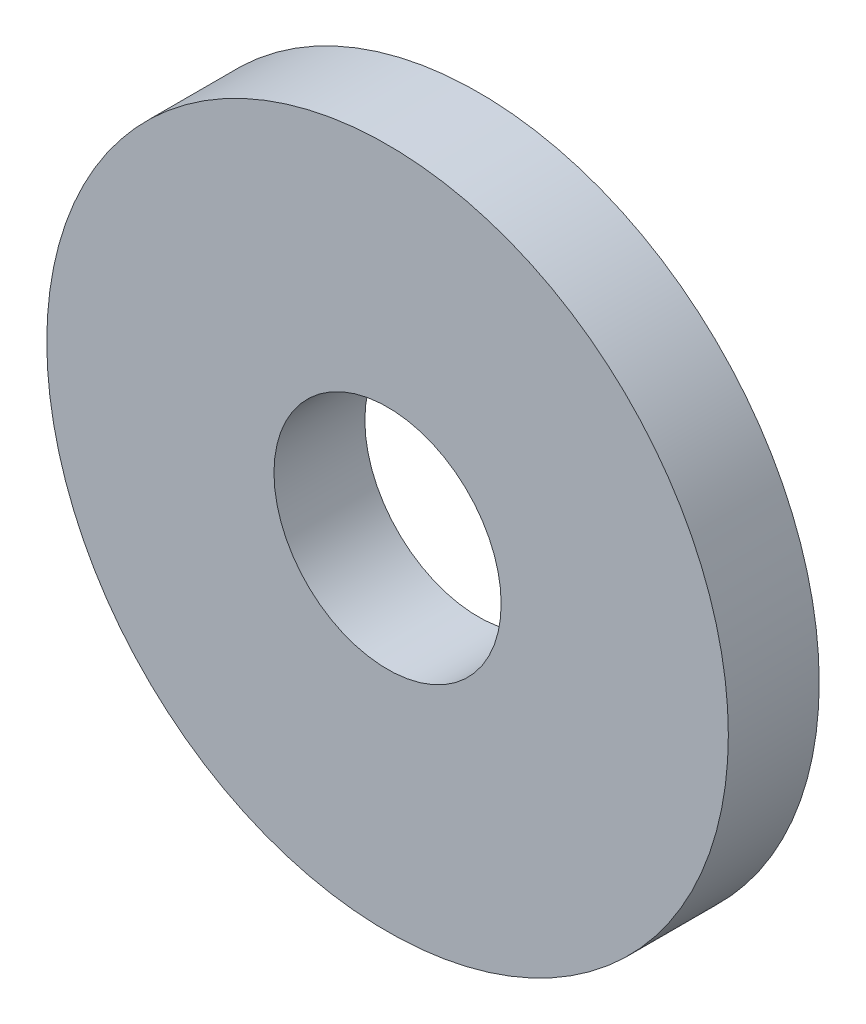
ISO-10303-21;
HEADER;
FILE_DESCRIPTION(('STEP AP214'),'2;1');
FILE_NAME('part.step','',(''),(''),'','','');
FILE_SCHEMA(('AUTOMOTIVE_DESIGN { 1 0 10303 214 1 1 1 1 }'));
ENDSEC;
DATA;
#1=APPLICATION_CONTEXT('core data for automotive mechanical design processes');
#2=APPLICATION_PROTOCOL_DEFINITION('international standard','automotive_design',2000,#1);
#3=PRODUCT_CONTEXT('',#1,'mechanical');
#4=PRODUCT('Part','Part','',(#3));
#5=PRODUCT_RELATED_PRODUCT_CATEGORY('part','',(#4));
#6=PRODUCT_DEFINITION_FORMATION('','',#4);
#7=PRODUCT_DEFINITION_CONTEXT('part definition',#1,'design');
#8=PRODUCT_DEFINITION('design','',#6,#7);
#9=PRODUCT_DEFINITION_SHAPE('','',#8);
#10=(LENGTH_UNIT() NAMED_UNIT(*) SI_UNIT(.MILLI.,.METRE.));
#11=(NAMED_UNIT(*) PLANE_ANGLE_UNIT() SI_UNIT($,.RADIAN.));
#12=(NAMED_UNIT(*) SI_UNIT($,.STERADIAN.) SOLID_ANGLE_UNIT());
#13=UNCERTAINTY_MEASURE_WITH_UNIT(LENGTH_MEASURE(1.E-05),#10,'distance_accuracy_value','');
#14=(GEOMETRIC_REPRESENTATION_CONTEXT(3) GLOBAL_UNCERTAINTY_ASSIGNED_CONTEXT((#13)) GLOBAL_UNIT_ASSIGNED_CONTEXT((#10,
#11,#12)) REPRESENTATION_CONTEXT('',''));
#15=CARTESIAN_POINT('',(0.,0.,0.));
#16=DIRECTION('',(0.,0.,1.));
#17=DIRECTION('',(1.,0.,0.));
#18=AXIS2_PLACEMENT_3D('',#15,#16,#17);
#19=CARTESIAN_POINT('',(0.,0.,1.2));
#20=DIRECTION('',(0.,0.,1.));
#21=DIRECTION('',(1.,0.,0.));
#22=AXIS2_PLACEMENT_3D('',#19,#20,#21);
#23=PLANE('',#22);
#24=CARTESIAN_POINT('',(0.,0.,1.2));
#25=DIRECTION('',(0.,0.,1.));
#26=DIRECTION('',(1.,0.,0.));
#27=AXIS2_PLACEMENT_3D('',#24,#25,#26);
#28=CIRCLE('',#27,4.5);
#29=CARTESIAN_POINT('',(4.5,0.,1.2));
#30=VERTEX_POINT('',#29);
#31=EDGE_CURVE('E10',#30,#30,#28,.T.);
#32=ORIENTED_EDGE('',*,*,#31,.T.);
#33=EDGE_LOOP('',(#32));
#34=FACE_BOUND('',#33,.T.);
#35=CARTESIAN_POINT('',(0.,0.,1.2));
#36=DIRECTION('',(0.,0.,1.));
#37=DIRECTION('',(1.,0.,0.));
#38=AXIS2_PLACEMENT_3D('',#35,#36,#37);
#39=CIRCLE('',#38,1.5);
#40=CARTESIAN_POINT('',(1.5,0.,1.2));
#41=VERTEX_POINT('',#40);
#42=EDGE_CURVE('E35',#41,#41,#39,.T.);
#43=ORIENTED_EDGE('',*,*,#42,.F.);
#44=EDGE_LOOP('',(#43));
#45=FACE_BOUND('',#44,.T.);
#46=ADVANCED_FACE('F24',(#34,#45),#23,.T.);
#47=CARTESIAN_POINT('',(0.,0.,0.));
#48=DIRECTION('',(0.,0.,1.));
#49=DIRECTION('',(1.,0.,0.));
#50=AXIS2_PLACEMENT_3D('',#47,#48,#49);
#51=PLANE('',#50);
#52=CARTESIAN_POINT('',(0.,0.,0.));
#53=DIRECTION('',(0.,0.,1.));
#54=DIRECTION('',(1.,0.,0.));
#55=AXIS2_PLACEMENT_3D('',#52,#53,#54);
#56=CIRCLE('',#55,4.5);
#57=CARTESIAN_POINT('',(4.5,0.,0.));
#58=VERTEX_POINT('',#57);
#59=EDGE_CURVE('E31',#58,#58,#56,.T.);
#60=ORIENTED_EDGE('',*,*,#59,.F.);
#61=EDGE_LOOP('',(#60));
#62=FACE_BOUND('',#61,.T.);
#63=CARTESIAN_POINT('',(0.,0.,0.));
#64=DIRECTION('',(0.,0.,1.));
#65=DIRECTION('',(1.,0.,0.));
#66=AXIS2_PLACEMENT_3D('',#63,#64,#65);
#67=CIRCLE('',#66,1.5);
#68=CARTESIAN_POINT('',(1.5,0.,0.));
#69=VERTEX_POINT('',#68);
#70=EDGE_CURVE('E39',#69,#69,#67,.T.);
#71=ORIENTED_EDGE('',*,*,#70,.T.);
#72=EDGE_LOOP('',(#71));
#73=FACE_BOUND('',#72,.T.);
#74=ADVANCED_FACE('F45',(#62,#73),#51,.F.);
#75=CARTESIAN_POINT('',(0.,0.,1.2));
#76=DIRECTION('',(0.,0.,-1.));
#77=DIRECTION('',(-1.,0.,0.));
#78=AXIS2_PLACEMENT_3D('',#75,#76,#77);
#79=CYLINDRICAL_SURFACE('',#78,4.5);
#80=ORIENTED_EDGE('',*,*,#31,.F.);
#81=EDGE_LOOP('',(#80));
#82=FACE_BOUND('',#81,.T.);
#83=ORIENTED_EDGE('',*,*,#59,.T.);
#84=EDGE_LOOP('',(#83));
#85=FACE_BOUND('',#84,.T.);
#86=ADVANCED_FACE('F26',(#82,#85),#79,.T.);
#87=CARTESIAN_POINT('',(0.,0.,1.2));
#88=DIRECTION('',(0.,0.,-1.));
#89=DIRECTION('',(-1.,0.,0.));
#90=AXIS2_PLACEMENT_3D('',#87,#88,#89);
#91=CYLINDRICAL_SURFACE('',#90,1.5);
#92=ORIENTED_EDGE('',*,*,#42,.T.);
#93=EDGE_LOOP('',(#92));
#94=FACE_BOUND('',#93,.T.);
#95=ORIENTED_EDGE('',*,*,#70,.F.);
#96=EDGE_LOOP('',(#95));
#97=FACE_BOUND('',#96,.T.);
#98=ADVANCED_FACE('F47',(#94,#97),#91,.F.);
#99=CLOSED_SHELL('',(#46,#74,#86,#98));
#100=MANIFOLD_SOLID_BREP('B2',#99);
#101=ADVANCED_BREP_SHAPE_REPRESENTATION('',(#18,#100),#14);
#102=SHAPE_DEFINITION_REPRESENTATION(#9,#101);
ENDSEC;
END-ISO-10303-21;
